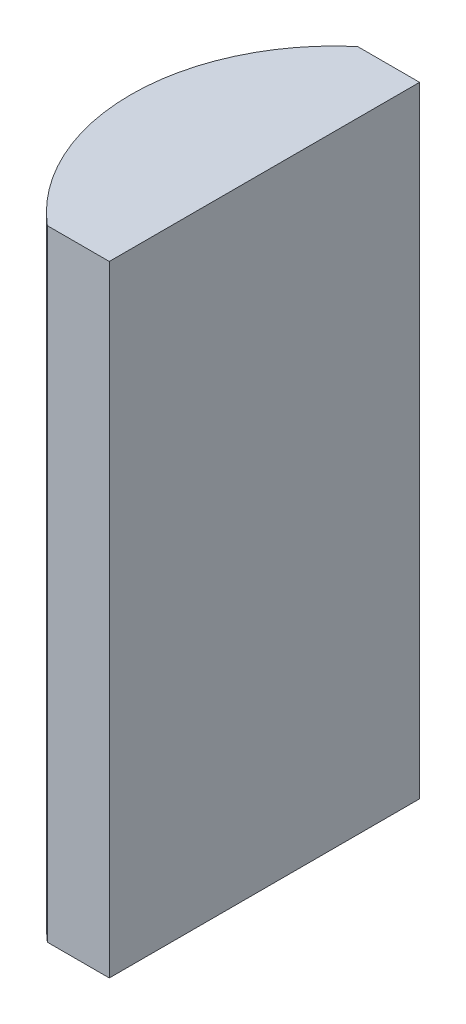
ISO-10303-21;
HEADER;
FILE_DESCRIPTION(('STEP AP214'),'2;1');
FILE_NAME('part.step','',(''),(''),'','','');
FILE_SCHEMA(('AUTOMOTIVE_DESIGN { 1 0 10303 214 1 1 1 1 }'));
ENDSEC;
DATA;
#1=APPLICATION_CONTEXT('core data for automotive mechanical design processes');
#2=APPLICATION_PROTOCOL_DEFINITION('international standard','automotive_design',2000,#1);
#3=PRODUCT_CONTEXT('',#1,'mechanical');
#4=PRODUCT('Part','Part','',(#3));
#5=PRODUCT_RELATED_PRODUCT_CATEGORY('part','',(#4));
#6=PRODUCT_DEFINITION_FORMATION('','',#4);
#7=PRODUCT_DEFINITION_CONTEXT('part definition',#1,'design');
#8=PRODUCT_DEFINITION('design','',#6,#7);
#9=PRODUCT_DEFINITION_SHAPE('','',#8);
#10=(LENGTH_UNIT() NAMED_UNIT(*) SI_UNIT(.MILLI.,.METRE.));
#11=(NAMED_UNIT(*) PLANE_ANGLE_UNIT() SI_UNIT($,.RADIAN.));
#12=(NAMED_UNIT(*) SI_UNIT($,.STERADIAN.) SOLID_ANGLE_UNIT());
#13=UNCERTAINTY_MEASURE_WITH_UNIT(LENGTH_MEASURE(1.E-05),#10,'distance_accuracy_value','');
#14=(GEOMETRIC_REPRESENTATION_CONTEXT(3) GLOBAL_UNCERTAINTY_ASSIGNED_CONTEXT((#13)) GLOBAL_UNIT_ASSIGNED_CONTEXT((#10,
#11,#12)) REPRESENTATION_CONTEXT('',''));
#15=CARTESIAN_POINT('',(0.,0.,0.));
#16=DIRECTION('',(0.,0.,1.));
#17=DIRECTION('',(1.,0.,0.));
#18=AXIS2_PLACEMENT_3D('',#15,#16,#17);
#19=CARTESIAN_POINT('',(4.35520433485127,20.,0.));
#20=DIRECTION('',(0.,-1.,0.));
#21=DIRECTION('',(0.,0.,-1.));
#22=AXIS2_PLACEMENT_3D('',#19,#20,#21);
#23=CYLINDRICAL_SURFACE('',#22,6.56000000000001);
#24=CARTESIAN_POINT('',(4.35520433485127,0.,0.));
#25=DIRECTION('',(0.,1.,0.));
#26=DIRECTION('',(0.,0.,1.));
#27=AXIS2_PLACEMENT_3D('',#24,#25,#26);
#28=CIRCLE('',#27,6.56000000000001);
#29=CARTESIAN_POINT('',(0.108605695940333,0.,-5.));
#30=VERTEX_POINT('',#29);
#31=CARTESIAN_POINT('',(0.108605695940333,0.,5.));
#32=VERTEX_POINT('',#31);
#33=EDGE_CURVE('E100',#30,#32,#28,.T.);
#34=ORIENTED_EDGE('',*,*,#33,.T.);
#35=DIRECTION('',(0.,-1.,0.));
#36=VECTOR('',#35,1.);
#37=CARTESIAN_POINT('',(0.108605695940333,20.,5.));
#38=LINE('',#37,#36);
#39=CARTESIAN_POINT('',(0.108605695940333,20.,5.));
#40=VERTEX_POINT('',#39);
#41=EDGE_CURVE('E11',#40,#32,#38,.T.);
#42=ORIENTED_EDGE('',*,*,#41,.F.);
#43=CARTESIAN_POINT('',(4.35520433485127,20.,0.));
#44=DIRECTION('',(0.,1.,0.));
#45=DIRECTION('',(0.,0.,1.));
#46=AXIS2_PLACEMENT_3D('',#43,#44,#45);
#47=CIRCLE('',#46,6.56000000000001);
#48=CARTESIAN_POINT('',(0.108605695940333,20.,-5.));
#49=VERTEX_POINT('',#48);
#50=EDGE_CURVE('E88',#49,#40,#47,.T.);
#51=ORIENTED_EDGE('',*,*,#50,.F.);
#52=DIRECTION('',(0.,-1.,0.));
#53=VECTOR('',#52,1.);
#54=CARTESIAN_POINT('',(0.108605695940333,20.,-5.));
#55=LINE('',#54,#53);
#56=EDGE_CURVE('E96',#49,#30,#55,.T.);
#57=ORIENTED_EDGE('',*,*,#56,.T.);
#58=EDGE_LOOP('',(#34,#42,#51,#57));
#59=FACE_BOUND('',#58,.T.);
#60=ADVANCED_FACE('F37',(#59),#23,.T.);
#61=CARTESIAN_POINT('',(0.108605695940333,20.,5.));
#62=DIRECTION('',(0.,0.,-1.));
#63=DIRECTION('',(-1.,0.,0.));
#64=AXIS2_PLACEMENT_3D('',#61,#62,#63);
#65=PLANE('',#64);
#66=DIRECTION('',(1.,0.,0.));
#67=VECTOR('',#66,1.);
#68=CARTESIAN_POINT('',(0.108605695940333,0.,5.));
#69=LINE('',#68,#67);
#70=CARTESIAN_POINT('',(2.10520433485127,0.,5.));
#71=VERTEX_POINT('',#70);
#72=EDGE_CURVE('E92',#32,#71,#69,.T.);
#73=ORIENTED_EDGE('',*,*,#72,.T.);
#74=DIRECTION('',(0.,-1.,0.));
#75=VECTOR('',#74,1.);
#76=CARTESIAN_POINT('',(2.10520433485127,20.,5.));
#77=LINE('',#76,#75);
#78=CARTESIAN_POINT('',(2.10520433485127,20.,5.));
#79=VERTEX_POINT('',#78);
#80=EDGE_CURVE('E45',#79,#71,#77,.T.);
#81=ORIENTED_EDGE('',*,*,#80,.F.);
#82=DIRECTION('',(1.,0.,0.));
#83=VECTOR('',#82,1.);
#84=CARTESIAN_POINT('',(0.108605695940333,20.,5.));
#85=LINE('',#84,#83);
#86=EDGE_CURVE('E83',#40,#79,#85,.T.);
#87=ORIENTED_EDGE('',*,*,#86,.F.);
#88=ORIENTED_EDGE('',*,*,#41,.T.);
#89=EDGE_LOOP('',(#73,#81,#87,#88));
#90=FACE_BOUND('',#89,.T.);
#91=ADVANCED_FACE('F91',(#90),#65,.F.);
#92=CARTESIAN_POINT('',(2.10520433485126,20.,-5.));
#93=DIRECTION('',(-1.,0.,0.));
#94=DIRECTION('',(0.,0.,1.));
#95=AXIS2_PLACEMENT_3D('',#92,#93,#94);
#96=PLANE('',#95);
#97=DIRECTION('',(0.,0.,-1.));
#98=VECTOR('',#97,1.);
#99=CARTESIAN_POINT('',(2.10520433485126,0.,-5.));
#100=LINE('',#99,#98);
#101=CARTESIAN_POINT('',(2.10520433485126,0.,-5.));
#102=VERTEX_POINT('',#101);
#103=EDGE_CURVE('E70',#71,#102,#100,.T.);
#104=ORIENTED_EDGE('',*,*,#103,.T.);
#105=DIRECTION('',(0.,-1.,0.));
#106=VECTOR('',#105,1.);
#107=CARTESIAN_POINT('',(2.10520433485126,20.,-5.));
#108=LINE('',#107,#106);
#109=CARTESIAN_POINT('',(2.10520433485126,20.,-5.));
#110=VERTEX_POINT('',#109);
#111=EDGE_CURVE('E93',#110,#102,#108,.T.);
#112=ORIENTED_EDGE('',*,*,#111,.F.);
#113=DIRECTION('',(0.,0.,-1.));
#114=VECTOR('',#113,1.);
#115=CARTESIAN_POINT('',(2.10520433485126,20.,-5.));
#116=LINE('',#115,#114);
#117=EDGE_CURVE('E86',#79,#110,#116,.T.);
#118=ORIENTED_EDGE('',*,*,#117,.F.);
#119=ORIENTED_EDGE('',*,*,#80,.T.);
#120=EDGE_LOOP('',(#104,#112,#118,#119));
#121=FACE_BOUND('',#120,.T.);
#122=ADVANCED_FACE('F94',(#121),#96,.F.);
#123=CARTESIAN_POINT('',(0.108605695940333,20.,-5.));
#124=DIRECTION('',(0.,0.,1.));
#125=DIRECTION('',(1.,0.,0.));
#126=AXIS2_PLACEMENT_3D('',#123,#124,#125);
#127=PLANE('',#126);
#128=DIRECTION('',(-1.,0.,0.));
#129=VECTOR('',#128,1.);
#130=CARTESIAN_POINT('',(0.108605695940333,0.,-5.));
#131=LINE('',#130,#129);
#132=EDGE_CURVE('E76',#102,#30,#131,.T.);
#133=ORIENTED_EDGE('',*,*,#132,.T.);
#134=ORIENTED_EDGE('',*,*,#56,.F.);
#135=DIRECTION('',(-1.,0.,0.));
#136=VECTOR('',#135,1.);
#137=CARTESIAN_POINT('',(0.108605695940333,20.,-5.));
#138=LINE('',#137,#136);
#139=EDGE_CURVE('E53',#110,#49,#138,.T.);
#140=ORIENTED_EDGE('',*,*,#139,.F.);
#141=ORIENTED_EDGE('',*,*,#111,.T.);
#142=EDGE_LOOP('',(#133,#134,#140,#141));
#143=FACE_BOUND('',#142,.T.);
#144=ADVANCED_FACE('F107',(#143),#127,.F.);
#145=CARTESIAN_POINT('',(4.35520433485127,20.,0.));
#146=DIRECTION('',(0.,1.,0.));
#147=DIRECTION('',(0.,0.,1.));
#148=AXIS2_PLACEMENT_3D('',#145,#146,#147);
#149=PLANE('',#148);
#150=ORIENTED_EDGE('',*,*,#50,.T.);
#151=ORIENTED_EDGE('',*,*,#86,.T.);
#152=ORIENTED_EDGE('',*,*,#117,.T.);
#153=ORIENTED_EDGE('',*,*,#139,.T.);
#154=EDGE_LOOP('',(#150,#151,#152,#153));
#155=FACE_BOUND('',#154,.T.);
#156=ADVANCED_FACE('F84',(#155),#149,.T.);
#157=CARTESIAN_POINT('',(4.35520433485127,0.,0.));
#158=DIRECTION('',(0.,1.,0.));
#159=DIRECTION('',(0.,0.,1.));
#160=AXIS2_PLACEMENT_3D('',#157,#158,#159);
#161=PLANE('',#160);
#162=ORIENTED_EDGE('',*,*,#33,.F.);
#163=ORIENTED_EDGE('',*,*,#132,.F.);
#164=ORIENTED_EDGE('',*,*,#103,.F.);
#165=ORIENTED_EDGE('',*,*,#72,.F.);
#166=EDGE_LOOP('',(#162,#163,#164,#165));
#167=FACE_BOUND('',#166,.T.);
#168=ADVANCED_FACE('F110',(#167),#161,.F.);
#169=CLOSED_SHELL('',(#60,#91,#122,#144,#156,#168));
#170=MANIFOLD_SOLID_BREP('B2',#169);
#171=ADVANCED_BREP_SHAPE_REPRESENTATION('',(#18,#170),#14);
#172=SHAPE_DEFINITION_REPRESENTATION(#9,#171);
ENDSEC;
END-ISO-10303-21;
